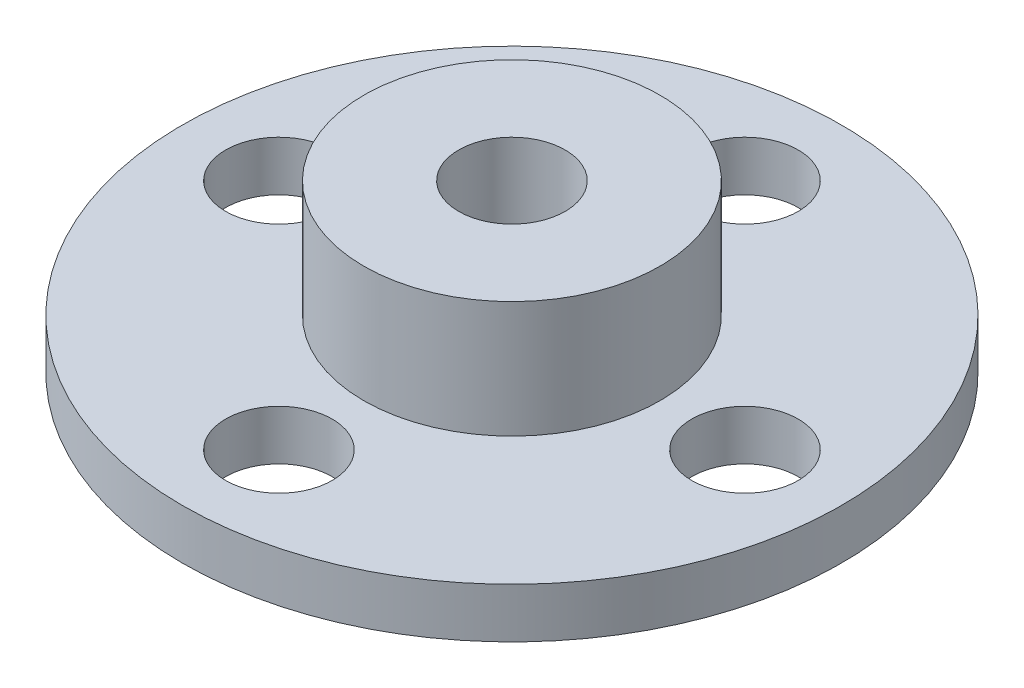
ISO-10303-21;
HEADER;
FILE_DESCRIPTION(('STEP AP214'),'2;1');
FILE_NAME('part.step','',(''),(''),'','','');
FILE_SCHEMA(('AUTOMOTIVE_DESIGN { 1 0 10303 214 1 1 1 1 }'));
ENDSEC;
DATA;
#1=APPLICATION_CONTEXT('core data for automotive mechanical design processes');
#2=APPLICATION_PROTOCOL_DEFINITION('international standard','automotive_design',2000,#1);
#3=PRODUCT_CONTEXT('',#1,'mechanical');
#4=PRODUCT('Part','Part','',(#3));
#5=PRODUCT_RELATED_PRODUCT_CATEGORY('part','',(#4));
#6=PRODUCT_DEFINITION_FORMATION('','',#4);
#7=PRODUCT_DEFINITION_CONTEXT('part definition',#1,'design');
#8=PRODUCT_DEFINITION('design','',#6,#7);
#9=PRODUCT_DEFINITION_SHAPE('','',#8);
#10=(LENGTH_UNIT() NAMED_UNIT(*) SI_UNIT(.MILLI.,.METRE.));
#11=(NAMED_UNIT(*) PLANE_ANGLE_UNIT() SI_UNIT($,.RADIAN.));
#12=(NAMED_UNIT(*) SI_UNIT($,.STERADIAN.) SOLID_ANGLE_UNIT());
#13=UNCERTAINTY_MEASURE_WITH_UNIT(LENGTH_MEASURE(1.E-05),#10,'distance_accuracy_value','');
#14=(GEOMETRIC_REPRESENTATION_CONTEXT(3) GLOBAL_UNCERTAINTY_ASSIGNED_CONTEXT((#13)) GLOBAL_UNIT_ASSIGNED_CONTEXT((#10,
#11,#12)) REPRESENTATION_CONTEXT('',''));
#15=CARTESIAN_POINT('',(0.,0.,0.));
#16=DIRECTION('',(0.,0.,1.));
#17=DIRECTION('',(1.,0.,0.));
#18=AXIS2_PLACEMENT_3D('',#15,#16,#17);
#19=CARTESIAN_POINT('',(0.,1.5,0.));
#20=DIRECTION('',(0.,1.,0.));
#21=DIRECTION('',(0.,0.,1.));
#22=AXIS2_PLACEMENT_3D('',#19,#20,#21);
#23=PLANE('',#22);
#24=CARTESIAN_POINT('',(-7.,1.5,0.));
#25=DIRECTION('',(0.,1.,0.));
#26=DIRECTION('',(0.,0.,1.));
#27=AXIS2_PLACEMENT_3D('',#24,#25,#26);
#28=CIRCLE('',#27,1.6);
#29=CARTESIAN_POINT('',(-7.,1.5,1.6));
#30=VERTEX_POINT('',#29);
#31=EDGE_CURVE('E67',#30,#30,#28,.T.);
#32=ORIENTED_EDGE('',*,*,#31,.F.);
#33=EDGE_LOOP('',(#32));
#34=FACE_BOUND('',#33,.T.);
#35=CARTESIAN_POINT('',(7.,1.5,0.));
#36=DIRECTION('',(0.,1.,0.));
#37=DIRECTION('',(0.,0.,1.));
#38=AXIS2_PLACEMENT_3D('',#35,#36,#37);
#39=CIRCLE('',#38,1.6);
#40=CARTESIAN_POINT('',(7.,1.5,1.6));
#41=VERTEX_POINT('',#40);
#42=EDGE_CURVE('E55',#41,#41,#39,.T.);
#43=ORIENTED_EDGE('',*,*,#42,.F.);
#44=EDGE_LOOP('',(#43));
#45=FACE_BOUND('',#44,.T.);
#46=CARTESIAN_POINT('',(0.,1.5,0.));
#47=DIRECTION('',(0.,1.,0.));
#48=DIRECTION('',(0.,0.,1.));
#49=AXIS2_PLACEMENT_3D('',#46,#47,#48);
#50=CIRCLE('',#49,9.9);
#51=CARTESIAN_POINT('',(0.,1.5,9.9));
#52=VERTEX_POINT('',#51);
#53=EDGE_CURVE('E10',#52,#52,#50,.T.);
#54=ORIENTED_EDGE('',*,*,#53,.T.);
#55=EDGE_LOOP('',(#54));
#56=FACE_BOUND('',#55,.T.);
#57=CARTESIAN_POINT('',(0.,1.5,-7.));
#58=DIRECTION('',(0.,1.,0.));
#59=DIRECTION('',(0.,0.,1.));
#60=AXIS2_PLACEMENT_3D('',#57,#58,#59);
#61=CIRCLE('',#60,1.6);
#62=CARTESIAN_POINT('',(0.,1.5,-5.4));
#63=VERTEX_POINT('',#62);
#64=EDGE_CURVE('E51',#63,#63,#61,.T.);
#65=ORIENTED_EDGE('',*,*,#64,.F.);
#66=EDGE_LOOP('',(#65));
#67=FACE_BOUND('',#66,.T.);
#68=CARTESIAN_POINT('',(0.,1.5,7.));
#69=DIRECTION('',(0.,1.,0.));
#70=DIRECTION('',(0.,0.,1.));
#71=AXIS2_PLACEMENT_3D('',#68,#69,#70);
#72=CIRCLE('',#71,1.6);
#73=CARTESIAN_POINT('',(0.,1.5,8.6));
#74=VERTEX_POINT('',#73);
#75=EDGE_CURVE('E61',#74,#74,#72,.T.);
#76=ORIENTED_EDGE('',*,*,#75,.F.);
#77=EDGE_LOOP('',(#76));
#78=FACE_BOUND('',#77,.T.);
#79=CARTESIAN_POINT('',(0.,1.5,0.));
#80=DIRECTION('',(0.,1.,0.));
#81=DIRECTION('',(0.,0.,1.));
#82=AXIS2_PLACEMENT_3D('',#79,#80,#81);
#83=CIRCLE('',#82,4.45);
#84=CARTESIAN_POINT('',(0.,1.5,4.45));
#85=VERTEX_POINT('',#84);
#86=EDGE_CURVE('E76',#85,#85,#83,.T.);
#87=ORIENTED_EDGE('',*,*,#86,.F.);
#88=EDGE_LOOP('',(#87));
#89=FACE_BOUND('',#88,.T.);
#90=ADVANCED_FACE('F36',(#34,#45,#56,#67,#78,#89),#23,.T.);
#91=CARTESIAN_POINT('',(0.,0.,0.));
#92=DIRECTION('',(0.,1.,0.));
#93=DIRECTION('',(0.,0.,1.));
#94=AXIS2_PLACEMENT_3D('',#91,#92,#93);
#95=PLANE('',#94);
#96=CARTESIAN_POINT('',(0.,0.,0.));
#97=DIRECTION('',(0.,1.,0.));
#98=DIRECTION('',(0.,0.,1.));
#99=AXIS2_PLACEMENT_3D('',#96,#97,#98);
#100=CIRCLE('',#99,9.9);
#101=CARTESIAN_POINT('',(0.,0.,9.9));
#102=VERTEX_POINT('',#101);
#103=EDGE_CURVE('E40',#102,#102,#100,.T.);
#104=ORIENTED_EDGE('',*,*,#103,.F.);
#105=EDGE_LOOP('',(#104));
#106=FACE_BOUND('',#105,.T.);
#107=CARTESIAN_POINT('',(0.,0.,0.));
#108=DIRECTION('',(0.,1.,0.));
#109=DIRECTION('',(0.,0.,1.));
#110=AXIS2_PLACEMENT_3D('',#107,#108,#109);
#111=CIRCLE('',#110,1.6);
#112=CARTESIAN_POINT('',(0.,0.,1.6));
#113=VERTEX_POINT('',#112);
#114=EDGE_CURVE('E47',#113,#113,#111,.T.);
#115=ORIENTED_EDGE('',*,*,#114,.T.);
#116=EDGE_LOOP('',(#115));
#117=FACE_BOUND('',#116,.T.);
#118=CARTESIAN_POINT('',(0.,0.,-7.));
#119=DIRECTION('',(0.,1.,0.));
#120=DIRECTION('',(0.,0.,1.));
#121=AXIS2_PLACEMENT_3D('',#118,#119,#120);
#122=CIRCLE('',#121,1.6);
#123=CARTESIAN_POINT('',(0.,0.,-5.4));
#124=VERTEX_POINT('',#123);
#125=EDGE_CURVE('E52',#124,#124,#122,.T.);
#126=ORIENTED_EDGE('',*,*,#125,.T.);
#127=EDGE_LOOP('',(#126));
#128=FACE_BOUND('',#127,.T.);
#129=CARTESIAN_POINT('',(7.,0.,0.));
#130=DIRECTION('',(0.,1.,0.));
#131=DIRECTION('',(0.,0.,1.));
#132=AXIS2_PLACEMENT_3D('',#129,#130,#131);
#133=CIRCLE('',#132,1.6);
#134=CARTESIAN_POINT('',(7.,0.,1.6));
#135=VERTEX_POINT('',#134);
#136=EDGE_CURVE('E58',#135,#135,#133,.T.);
#137=ORIENTED_EDGE('',*,*,#136,.T.);
#138=EDGE_LOOP('',(#137));
#139=FACE_BOUND('',#138,.T.);
#140=CARTESIAN_POINT('',(0.,0.,7.));
#141=DIRECTION('',(0.,1.,0.));
#142=DIRECTION('',(0.,0.,1.));
#143=AXIS2_PLACEMENT_3D('',#140,#141,#142);
#144=CIRCLE('',#143,1.6);
#145=CARTESIAN_POINT('',(0.,0.,8.6));
#146=VERTEX_POINT('',#145);
#147=EDGE_CURVE('E64',#146,#146,#144,.T.);
#148=ORIENTED_EDGE('',*,*,#147,.T.);
#149=EDGE_LOOP('',(#148));
#150=FACE_BOUND('',#149,.T.);
#151=CARTESIAN_POINT('',(-7.,0.,0.));
#152=DIRECTION('',(0.,1.,0.));
#153=DIRECTION('',(0.,0.,1.));
#154=AXIS2_PLACEMENT_3D('',#151,#152,#153);
#155=CIRCLE('',#154,1.6);
#156=CARTESIAN_POINT('',(-7.,0.,1.6));
#157=VERTEX_POINT('',#156);
#158=EDGE_CURVE('E70',#157,#157,#155,.T.);
#159=ORIENTED_EDGE('',*,*,#158,.T.);
#160=EDGE_LOOP('',(#159));
#161=FACE_BOUND('',#160,.T.);
#162=ADVANCED_FACE('F103',(#106,#117,#128,#139,#150,#161),#95,.F.);
#163=CARTESIAN_POINT('',(0.,1.5,0.));
#164=DIRECTION('',(0.,-1.,0.));
#165=DIRECTION('',(0.,0.,-1.));
#166=AXIS2_PLACEMENT_3D('',#163,#164,#165);
#167=CYLINDRICAL_SURFACE('',#166,9.9);
#168=ORIENTED_EDGE('',*,*,#53,.F.);
#169=EDGE_LOOP('',(#168));
#170=FACE_BOUND('',#169,.T.);
#171=ORIENTED_EDGE('',*,*,#103,.T.);
#172=EDGE_LOOP('',(#171));
#173=FACE_BOUND('',#172,.T.);
#174=ADVANCED_FACE('F38',(#170,#173),#167,.T.);
#175=CARTESIAN_POINT('',(0.,1.5,0.));
#176=DIRECTION('',(0.,-1.,0.));
#177=DIRECTION('',(0.,0.,-1.));
#178=AXIS2_PLACEMENT_3D('',#175,#176,#177);
#179=CYLINDRICAL_SURFACE('',#178,1.6);
#180=ORIENTED_EDGE('',*,*,#114,.F.);
#181=EDGE_LOOP('',(#180));
#182=FACE_BOUND('',#181,.T.);
#183=CARTESIAN_POINT('',(0.,5.,0.));
#184=DIRECTION('',(0.,1.,0.));
#185=DIRECTION('',(0.,0.,1.));
#186=AXIS2_PLACEMENT_3D('',#183,#184,#185);
#187=CIRCLE('',#186,1.6);
#188=CARTESIAN_POINT('',(0.,5.,1.6));
#189=VERTEX_POINT('',#188);
#190=EDGE_CURVE('E79',#189,#189,#187,.T.);
#191=ORIENTED_EDGE('',*,*,#190,.T.);
#192=EDGE_LOOP('',(#191));
#193=FACE_BOUND('',#192,.T.);
#194=ADVANCED_FACE('F85',(#182,#193),#179,.F.);
#195=CARTESIAN_POINT('',(0.,1.5,-7.));
#196=DIRECTION('',(0.,-1.,0.));
#197=DIRECTION('',(0.,0.,-1.));
#198=AXIS2_PLACEMENT_3D('',#195,#196,#197);
#199=CYLINDRICAL_SURFACE('',#198,1.6);
#200=ORIENTED_EDGE('',*,*,#64,.T.);
#201=EDGE_LOOP('',(#200));
#202=FACE_BOUND('',#201,.T.);
#203=ORIENTED_EDGE('',*,*,#125,.F.);
#204=EDGE_LOOP('',(#203));
#205=FACE_BOUND('',#204,.T.);
#206=ADVANCED_FACE('F115',(#202,#205),#199,.F.);
#207=CARTESIAN_POINT('',(7.,1.5,0.));
#208=DIRECTION('',(0.,-1.,0.));
#209=DIRECTION('',(0.,0.,-1.));
#210=AXIS2_PLACEMENT_3D('',#207,#208,#209);
#211=CYLINDRICAL_SURFACE('',#210,1.6);
#212=ORIENTED_EDGE('',*,*,#42,.T.);
#213=EDGE_LOOP('',(#212));
#214=FACE_BOUND('',#213,.T.);
#215=ORIENTED_EDGE('',*,*,#136,.F.);
#216=EDGE_LOOP('',(#215));
#217=FACE_BOUND('',#216,.T.);
#218=ADVANCED_FACE('F119',(#214,#217),#211,.F.);
#219=CARTESIAN_POINT('',(0.,1.5,7.));
#220=DIRECTION('',(0.,-1.,0.));
#221=DIRECTION('',(0.,0.,-1.));
#222=AXIS2_PLACEMENT_3D('',#219,#220,#221);
#223=CYLINDRICAL_SURFACE('',#222,1.6);
#224=ORIENTED_EDGE('',*,*,#75,.T.);
#225=EDGE_LOOP('',(#224));
#226=FACE_BOUND('',#225,.T.);
#227=ORIENTED_EDGE('',*,*,#147,.F.);
#228=EDGE_LOOP('',(#227));
#229=FACE_BOUND('',#228,.T.);
#230=ADVANCED_FACE('F99',(#226,#229),#223,.F.);
#231=CARTESIAN_POINT('',(-7.,1.5,0.));
#232=DIRECTION('',(0.,-1.,0.));
#233=DIRECTION('',(0.,0.,-1.));
#234=AXIS2_PLACEMENT_3D('',#231,#232,#233);
#235=CYLINDRICAL_SURFACE('',#234,1.6);
#236=ORIENTED_EDGE('',*,*,#31,.T.);
#237=EDGE_LOOP('',(#236));
#238=FACE_BOUND('',#237,.T.);
#239=ORIENTED_EDGE('',*,*,#158,.F.);
#240=EDGE_LOOP('',(#239));
#241=FACE_BOUND('',#240,.T.);
#242=ADVANCED_FACE('F90',(#238,#241),#235,.F.);
#243=CARTESIAN_POINT('',(0.,5.,0.));
#244=DIRECTION('',(0.,1.,0.));
#245=DIRECTION('',(0.,0.,1.));
#246=AXIS2_PLACEMENT_3D('',#243,#244,#245);
#247=PLANE('',#246);
#248=CARTESIAN_POINT('',(0.,5.,0.));
#249=DIRECTION('',(0.,1.,0.));
#250=DIRECTION('',(0.,0.,1.));
#251=AXIS2_PLACEMENT_3D('',#248,#249,#250);
#252=CIRCLE('',#251,4.45);
#253=CARTESIAN_POINT('',(0.,5.,4.45));
#254=VERTEX_POINT('',#253);
#255=EDGE_CURVE('E73',#254,#254,#252,.T.);
#256=ORIENTED_EDGE('',*,*,#255,.T.);
#257=EDGE_LOOP('',(#256));
#258=FACE_BOUND('',#257,.T.);
#259=ORIENTED_EDGE('',*,*,#190,.F.);
#260=EDGE_LOOP('',(#259));
#261=FACE_BOUND('',#260,.T.);
#262=ADVANCED_FACE('F87',(#258,#261),#247,.T.);
#263=CARTESIAN_POINT('',(0.,5.,0.));
#264=DIRECTION('',(0.,-1.,0.));
#265=DIRECTION('',(0.,0.,-1.));
#266=AXIS2_PLACEMENT_3D('',#263,#264,#265);
#267=CYLINDRICAL_SURFACE('',#266,4.45);
#268=ORIENTED_EDGE('',*,*,#255,.F.);
#269=EDGE_LOOP('',(#268));
#270=FACE_BOUND('',#269,.T.);
#271=ORIENTED_EDGE('',*,*,#86,.T.);
#272=EDGE_LOOP('',(#271));
#273=FACE_BOUND('',#272,.T.);
#274=ADVANCED_FACE('F89',(#270,#273),#267,.T.);
#275=CLOSED_SHELL('',(#90,#162,#174,#194,#206,#218,#230,#242,#262,#274));
#276=MANIFOLD_SOLID_BREP('B2',#275);
#277=ADVANCED_BREP_SHAPE_REPRESENTATION('',(#18,#276),#14);
#278=SHAPE_DEFINITION_REPRESENTATION(#9,#277);
ENDSEC;
END-ISO-10303-21;
